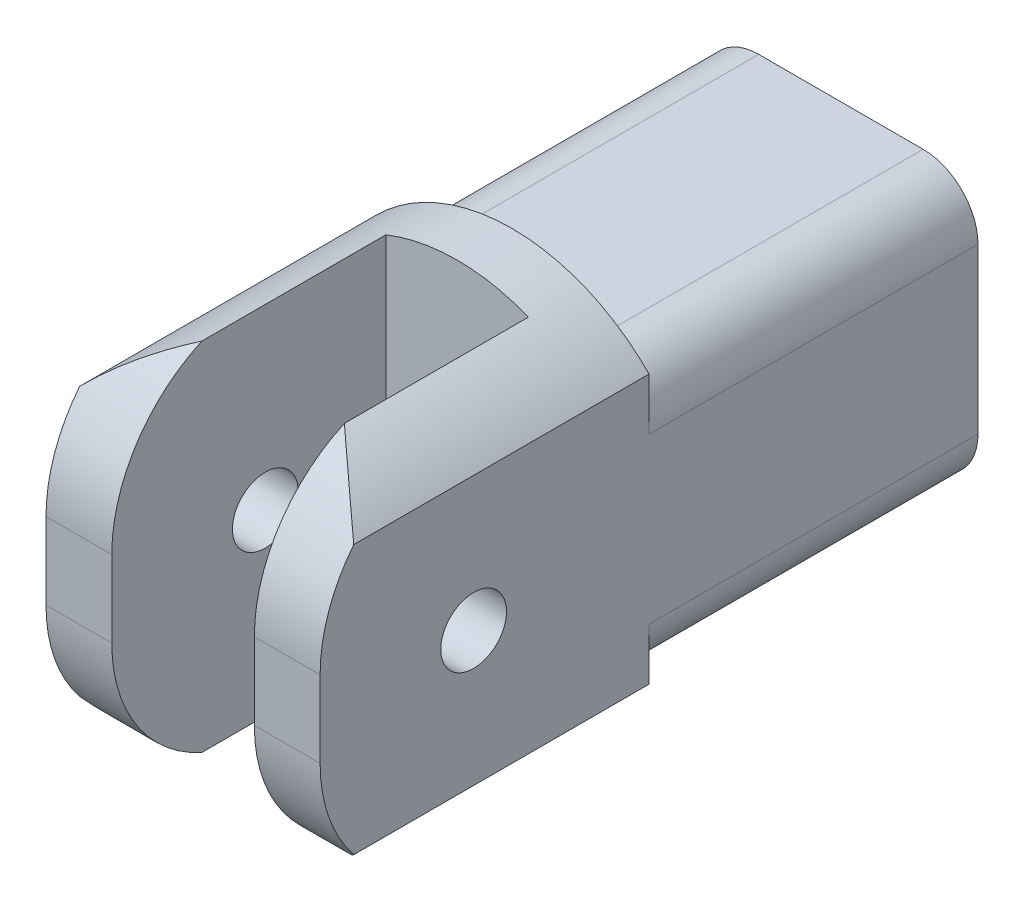
ISO-10303-21;
HEADER;
FILE_DESCRIPTION(('STEP AP214'),'2;1');
FILE_NAME('part.step','',(''),(''),'','','');
FILE_SCHEMA(('AUTOMOTIVE_DESIGN { 1 0 10303 214 1 1 1 1 }'));
ENDSEC;
DATA;
#1=APPLICATION_CONTEXT('core data for automotive mechanical design processes');
#2=APPLICATION_PROTOCOL_DEFINITION('international standard','automotive_design',2000,#1);
#3=PRODUCT_CONTEXT('',#1,'mechanical');
#4=PRODUCT('Part','Part','',(#3));
#5=PRODUCT_RELATED_PRODUCT_CATEGORY('part','',(#4));
#6=PRODUCT_DEFINITION_FORMATION('','',#4);
#7=PRODUCT_DEFINITION_CONTEXT('part definition',#1,'design');
#8=PRODUCT_DEFINITION('design','',#6,#7);
#9=PRODUCT_DEFINITION_SHAPE('','',#8);
#10=(LENGTH_UNIT() NAMED_UNIT(*) SI_UNIT(.MILLI.,.METRE.));
#11=(NAMED_UNIT(*) PLANE_ANGLE_UNIT() SI_UNIT($,.RADIAN.));
#12=(NAMED_UNIT(*) SI_UNIT($,.STERADIAN.) SOLID_ANGLE_UNIT());
#13=UNCERTAINTY_MEASURE_WITH_UNIT(LENGTH_MEASURE(1.E-05),#10,'distance_accuracy_value','');
#14=(GEOMETRIC_REPRESENTATION_CONTEXT(3) GLOBAL_UNCERTAINTY_ASSIGNED_CONTEXT((#13)) GLOBAL_UNIT_ASSIGNED_CONTEXT((#10,
#11,#12)) REPRESENTATION_CONTEXT('',''));
#15=CARTESIAN_POINT('',(0.,0.,0.));
#16=DIRECTION('',(0.,0.,1.));
#17=DIRECTION('',(1.,0.,0.));
#18=AXIS2_PLACEMENT_3D('',#15,#16,#17);
#19=CARTESIAN_POINT('',(25.,3.5,-21.7381489543648));
#20=DIRECTION('',(-1.,0.,0.));
#21=DIRECTION('',(0.,0.,1.));
#22=AXIS2_PLACEMENT_3D('',#19,#20,#21);
#23=CYLINDRICAL_SURFACE('',#22,14.);
#24=CARTESIAN_POINT('',(19.,16.2480768092719,-15.9513935884534));
#25=CARTESIAN_POINT('',(19.2137062616247,16.1625796337887,-15.763056389056));
#26=CARTESIAN_POINT('',(19.4265332479757,16.072552167909,-15.5758066612066));
#27=CARTESIAN_POINT('',(19.850237329306,15.8832582879784,-15.2037387297706));
#28=CARTESIAN_POINT('',(20.0611142136163,15.7839908882665,-15.018920787998));
#29=CARTESIAN_POINT('',(20.6910915022025,15.471779219296,-14.4680112543608));
#30=CARTESIAN_POINT('',(21.1068983672848,15.2446800268905,-14.106028663245));
#31=CARTESIAN_POINT('',(21.9209696044722,14.7552537635126,-13.4014531574795));
#32=CARTESIAN_POINT('',(22.3194044370628,14.4935136185156,-13.0586493528151));
#33=CARTESIAN_POINT('',(23.1023143734355,13.9310075067408,-12.390172447785));
#34=CARTESIAN_POINT('',(23.4868021642348,13.630278207072,-12.0644836511206));
#35=CARTESIAN_POINT('',(24.0568156971809,13.1436352348344,-11.5865857198591));
#36=CARTESIAN_POINT('',(24.2486270052411,12.9725409247646,-11.4266607327881));
#37=CARTESIAN_POINT('',(24.6279106548117,12.6186870646272,-11.1124396010336));
#38=CARTESIAN_POINT('',(24.8153631426692,12.4358845972718,-10.9581678580672));
#39=CARTESIAN_POINT('',(25.,12.2474487139158,-10.8073602821138));
#40=B_SPLINE_CURVE_WITH_KNOTS('',3,(#24,#25,#26,#27,#28,#29,#30,#31,#32,#33,#34,#35,#36,#37,#38,
#39),.UNSPECIFIED.,.F.,.F.,(4,2,2,2,2,2,2,4),(0.,0.892142453159571,1.78438018406066,
3.57152274771991,5.3315434553563,7.08992080870461,7.99781753410152,8.90925727115645),.UNSPECIFIED.);
#41=CARTESIAN_POINT('',(19.,16.2480768092719,-15.9513935884534));
#42=VERTEX_POINT('',#41);
#43=CARTESIAN_POINT('',(25.,12.2474487139158,-10.8073602821138));
#44=VERTEX_POINT('',#43);
#45=EDGE_CURVE('E203',#42,#44,#40,.T.);
#46=ORIENTED_EDGE('',*,*,#45,.F.);
#47=CARTESIAN_POINT('',(19.,3.5,-21.7381489543648));
#48=DIRECTION('',(1.,0.,0.));
#49=DIRECTION('',(0.,0.,-1.));
#50=AXIS2_PLACEMENT_3D('',#47,#48,#49);
#51=CIRCLE('',#50,14.);
#52=CARTESIAN_POINT('',(19.,3.5,-7.73814895436485));
#53=VERTEX_POINT('',#52);
#54=EDGE_CURVE('E336',#42,#53,#51,.T.);
#55=ORIENTED_EDGE('',*,*,#54,.T.);
#56=DIRECTION('',(-1.,0.,0.));
#57=VECTOR('',#56,1.);
#58=CARTESIAN_POINT('',(25.,3.4999999999999,-7.73814895436485));
#59=LINE('',#58,#57);
#60=CARTESIAN_POINT('',(25.,3.4999999999999,-7.73814895436485));
#61=VERTEX_POINT('',#60);
#62=EDGE_CURVE('E251',#61,#53,#59,.T.);
#63=ORIENTED_EDGE('',*,*,#62,.F.);
#64=CARTESIAN_POINT('',(25.,3.5,-21.7381489543648));
#65=DIRECTION('',(1.,0.,0.));
#66=DIRECTION('',(0.,0.,-1.));
#67=AXIS2_PLACEMENT_3D('',#64,#65,#66);
#68=CIRCLE('',#67,14.);
#69=EDGE_CURVE('E213',#44,#61,#68,.T.);
#70=ORIENTED_EDGE('',*,*,#69,.F.);
#71=EDGE_LOOP('',(#46,#55,#63,#70));
#72=FACE_BOUND('',#71,.T.);
#73=ADVANCED_FACE('F53',(#72),#23,.T.);
#74=CARTESIAN_POINT('',(25.,-3.5,-21.7381489543649));
#75=DIRECTION('',(-1.,0.,0.));
#76=DIRECTION('',(0.,0.,1.));
#77=AXIS2_PLACEMENT_3D('',#74,#75,#76);
#78=CYLINDRICAL_SURFACE('',#77,14.);
#79=CARTESIAN_POINT('',(25.,-12.247448713916,-10.8073602821139));
#80=CARTESIAN_POINT('',(24.8182792420741,-12.4329087519221,-10.9557858482555));
#81=CARTESIAN_POINT('',(24.6338314180846,-12.6129113017434,-11.1075670245429));
#82=CARTESIAN_POINT('',(24.2600096271792,-12.9621617203992,-11.4171996226308));
#83=CARTESIAN_POINT('',(24.0706367092498,-13.1314118533565,-11.5750497551867));
#84=CARTESIAN_POINT('',(23.4961751334086,-13.6230711261891,-12.0565286209721));
#85=CARTESIAN_POINT('',(23.1043907332403,-13.9297466006762,-12.3883748923588));
#86=CARTESIAN_POINT('',(22.3118523690837,-14.4987084181039,-13.0651222812422));
#87=CARTESIAN_POINT('',(21.911277162655,-14.7615122290806,-13.4098022024479));
#88=CARTESIAN_POINT('',(21.0991113201426,-15.2489177367404,-14.1128092105947));
#89=CARTESIAN_POINT('',(20.6875219786371,-15.4735239004665,-14.4711346957418));
#90=CARTESIAN_POINT('',(20.0620862546046,-15.7835213858486,-15.018069779364));
#91=CARTESIAN_POINT('',(19.8514485778921,-15.8826939920516,-15.2026767346474));
#92=CARTESIAN_POINT('',(19.4275058851693,-16.0721406934544,-15.5749509254546));
#93=CARTESIAN_POINT('',(19.2141943616068,-16.1623843497352,-15.7626262483462));
#94=CARTESIAN_POINT('',(19.,-16.248076809272,-15.9513935884537));
#95=B_SPLINE_CURVE_WITH_KNOTS('',3,(#79,#80,#81,#82,#83,#84,#85,#86,#87,#88,#89,#90,#91,#92,#93,
#94),.UNSPECIFIED.,.F.,.F.,(4,2,2,2,2,2,2,4),(0.,0.897047580315882,1.79390564006033,
3.58588896623243,5.3549578137075,7.12381963405831,8.01506017764537,8.9092412406068),.UNSPECIFIED.);
#96=CARTESIAN_POINT('',(25.,-12.247448713916,-10.8073602821139));
#97=VERTEX_POINT('',#96);
#98=CARTESIAN_POINT('',(19.,-16.248076809272,-15.9513935884537));
#99=VERTEX_POINT('',#98);
#100=EDGE_CURVE('E415',#97,#99,#95,.T.);
#101=ORIENTED_EDGE('',*,*,#100,.F.);
#102=CARTESIAN_POINT('',(25.,-3.5,-21.7381489543649));
#103=DIRECTION('',(1.,0.,0.));
#104=DIRECTION('',(0.,0.,-1.));
#105=AXIS2_PLACEMENT_3D('',#102,#103,#104);
#106=CIRCLE('',#105,14.);
#107=CARTESIAN_POINT('',(25.,-3.4999999999999,-7.73814895436485));
#108=VERTEX_POINT('',#107);
#109=EDGE_CURVE('E223',#108,#97,#106,.T.);
#110=ORIENTED_EDGE('',*,*,#109,.F.);
#111=DIRECTION('',(-1.,0.,0.));
#112=VECTOR('',#111,1.);
#113=CARTESIAN_POINT('',(25.,-3.4999999999999,-7.73814895436485));
#114=LINE('',#113,#112);
#115=CARTESIAN_POINT('',(19.,-3.5,-7.73814895436485));
#116=VERTEX_POINT('',#115);
#117=EDGE_CURVE('E247',#108,#116,#114,.T.);
#118=ORIENTED_EDGE('',*,*,#117,.T.);
#119=CARTESIAN_POINT('',(19.,-3.5,-21.7381489543649));
#120=DIRECTION('',(1.,0.,0.));
#121=DIRECTION('',(0.,0.,-1.));
#122=AXIS2_PLACEMENT_3D('',#119,#120,#121);
#123=CIRCLE('',#122,14.);
#124=EDGE_CURVE('E333',#116,#99,#123,.T.);
#125=ORIENTED_EDGE('',*,*,#124,.T.);
#126=EDGE_LOOP('',(#101,#110,#118,#125));
#127=FACE_BOUND('',#126,.T.);
#128=ADVANCED_FACE('F376',(#127),#78,.T.);
#129=CARTESIAN_POINT('',(25.,3.5,-21.7381489543648));
#130=DIRECTION('',(1.,0.,0.));
#131=DIRECTION('',(0.,0.,-1.));
#132=AXIS2_PLACEMENT_3D('',#129,#130,#131);
#133=PLANE('',#132);
#134=CARTESIAN_POINT('',(25.,0.,-21.7381489543648));
#135=DIRECTION('',(1.,0.,0.));
#136=DIRECTION('',(0.,0.,-1.));
#137=AXIS2_PLACEMENT_3D('',#134,#135,#136);
#138=CIRCLE('',#137,3.);
#139=CARTESIAN_POINT('',(25.,0.,-24.7381489543648));
#140=VERTEX_POINT('',#139);
#141=EDGE_CURVE('E230',#140,#140,#138,.T.);
#142=ORIENTED_EDGE('',*,*,#141,.F.);
#143=EDGE_LOOP('',(#142));
#144=FACE_BOUND('',#143,.T.);
#145=ORIENTED_EDGE('',*,*,#109,.T.);
#146=DIRECTION('',(0.,0.,-1.));
#147=VECTOR('',#146,1.);
#148=CARTESIAN_POINT('',(25.,-12.247448713916,1.26185104563508));
#149=LINE('',#148,#147);
#150=CARTESIAN_POINT('',(25.,-12.2474487139159,-37.7381489543649));
#151=VERTEX_POINT('',#150);
#152=EDGE_CURVE('E412',#97,#151,#149,.T.);
#153=ORIENTED_EDGE('',*,*,#152,.T.);
#154=DIRECTION('',(0.,1.,0.));
#155=VECTOR('',#154,1.);
#156=CARTESIAN_POINT('',(25.,-17.5,-37.7381489543649));
#157=LINE('',#156,#155);
#158=CARTESIAN_POINT('',(25.,-7.5,-37.7381489543649));
#159=VERTEX_POINT('',#158);
#160=EDGE_CURVE('E68',#151,#159,#157,.T.);
#161=ORIENTED_EDGE('',*,*,#160,.T.);
#162=DIRECTION('',(0.,0.,-1.));
#163=VECTOR('',#162,1.);
#164=CARTESIAN_POINT('',(25.,-7.5,-67.7381489543648));
#165=LINE('',#164,#163);
#166=CARTESIAN_POINT('',(25.,-7.5,-67.7381489543648));
#167=VERTEX_POINT('',#166);
#168=EDGE_CURVE('E292',#159,#167,#165,.T.);
#169=ORIENTED_EDGE('',*,*,#168,.T.);
#170=DIRECTION('',(0.,1.,0.));
#171=VECTOR('',#170,1.);
#172=CARTESIAN_POINT('',(25.,-12.5,-67.7381489543648));
#173=LINE('',#172,#171);
#174=CARTESIAN_POINT('',(25.,7.5,-67.7381489543648));
#175=VERTEX_POINT('',#174);
#176=EDGE_CURVE('E214',#167,#175,#173,.T.);
#177=ORIENTED_EDGE('',*,*,#176,.T.);
#178=DIRECTION('',(0.,0.,1.));
#179=VECTOR('',#178,1.);
#180=CARTESIAN_POINT('',(25.,7.49999999999999,-37.7381489543649));
#181=LINE('',#180,#179);
#182=CARTESIAN_POINT('',(25.,7.49999999999999,-37.7381489543649));
#183=VERTEX_POINT('',#182);
#184=EDGE_CURVE('E212',#175,#183,#181,.T.);
#185=ORIENTED_EDGE('',*,*,#184,.T.);
#186=DIRECTION('',(0.,1.,0.));
#187=VECTOR('',#186,1.);
#188=CARTESIAN_POINT('',(25.,12.5,-37.7381489543649));
#189=LINE('',#188,#187);
#190=CARTESIAN_POINT('',(25.,12.2474487139159,-37.7381489543649));
#191=VERTEX_POINT('',#190);
#192=EDGE_CURVE('E76',#183,#191,#189,.T.);
#193=ORIENTED_EDGE('',*,*,#192,.T.);
#194=DIRECTION('',(0.,0.,-1.));
#195=VECTOR('',#194,1.);
#196=CARTESIAN_POINT('',(25.,12.2474487139158,1.26185104563515));
#197=LINE('',#196,#195);
#198=EDGE_CURVE('E199',#191,#44,#197,.F.);
#199=ORIENTED_EDGE('',*,*,#198,.T.);
#200=ORIENTED_EDGE('',*,*,#69,.T.);
#201=DIRECTION('',(0.,-1.,0.));
#202=VECTOR('',#201,1.);
#203=CARTESIAN_POINT('',(25.,3.4999999999999,-7.73814895436485));
#204=LINE('',#203,#202);
#205=EDGE_CURVE('E216',#61,#108,#204,.T.);
#206=ORIENTED_EDGE('',*,*,#205,.T.);
#207=EDGE_LOOP('',(#145,#153,#161,#169,#177,#185,#193,#199,#200,#206));
#208=FACE_BOUND('',#207,.T.);
#209=ADVANCED_FACE('F209',(#144,#208),#133,.T.);
#210=CARTESIAN_POINT('',(0.,3.5,-21.7381489543648));
#211=DIRECTION('',(1.,0.,0.));
#212=DIRECTION('',(0.,0.,-1.));
#213=AXIS2_PLACEMENT_3D('',#210,#211,#212);
#214=PLANE('',#213);
#215=CARTESIAN_POINT('',(0.,0.,-21.7381489543648));
#216=DIRECTION('',(1.,0.,0.));
#217=DIRECTION('',(0.,0.,-1.));
#218=AXIS2_PLACEMENT_3D('',#215,#216,#217);
#219=CIRCLE('',#218,3.);
#220=CARTESIAN_POINT('',(0.,0.,-24.7381489543648));
#221=VERTEX_POINT('',#220);
#222=EDGE_CURVE('E344',#221,#221,#219,.T.);
#223=ORIENTED_EDGE('',*,*,#222,.T.);
#224=EDGE_LOOP('',(#223));
#225=FACE_BOUND('',#224,.T.);
#226=DIRECTION('',(0.,0.,-1.));
#227=VECTOR('',#226,1.);
#228=CARTESIAN_POINT('',(0.,-12.247448713916,1.26185104563508));
#229=LINE('',#228,#227);
#230=CARTESIAN_POINT('',(0.,-12.247448713916,-10.8073602821139));
#231=VERTEX_POINT('',#230);
#232=CARTESIAN_POINT('',(0.,-12.2474487139159,-37.7381489543649));
#233=VERTEX_POINT('',#232);
#234=EDGE_CURVE('E444',#231,#233,#229,.T.);
#235=ORIENTED_EDGE('',*,*,#234,.F.);
#236=CARTESIAN_POINT('',(0.,-3.5,-21.7381489543649));
#237=DIRECTION('',(1.,0.,0.));
#238=DIRECTION('',(0.,0.,-1.));
#239=AXIS2_PLACEMENT_3D('',#236,#237,#238);
#240=CIRCLE('',#239,14.);
#241=CARTESIAN_POINT('',(0.,-3.4999999999999,-7.73814895436485));
#242=VERTEX_POINT('',#241);
#243=EDGE_CURVE('E237',#242,#231,#240,.T.);
#244=ORIENTED_EDGE('',*,*,#243,.F.);
#245=DIRECTION('',(0.,-1.,0.));
#246=VECTOR('',#245,1.);
#247=CARTESIAN_POINT('',(0.,3.4999999999999,-7.73814895436485));
#248=LINE('',#247,#246);
#249=CARTESIAN_POINT('',(0.,3.4999999999999,-7.73814895436485));
#250=VERTEX_POINT('',#249);
#251=EDGE_CURVE('E234',#250,#242,#248,.T.);
#252=ORIENTED_EDGE('',*,*,#251,.F.);
#253=CARTESIAN_POINT('',(0.,3.5,-21.7381489543648));
#254=DIRECTION('',(1.,0.,0.));
#255=DIRECTION('',(0.,0.,-1.));
#256=AXIS2_PLACEMENT_3D('',#253,#254,#255);
#257=CIRCLE('',#256,14.);
#258=CARTESIAN_POINT('',(0.,12.2474487139158,-10.8073602821138));
#259=VERTEX_POINT('',#258);
#260=EDGE_CURVE('E232',#259,#250,#257,.T.);
#261=ORIENTED_EDGE('',*,*,#260,.F.);
#262=DIRECTION('',(0.,0.,-1.));
#263=VECTOR('',#262,1.);
#264=CARTESIAN_POINT('',(0.,12.2474487139158,1.26185104563515));
#265=LINE('',#264,#263);
#266=CARTESIAN_POINT('',(0.,12.2474487139159,-37.7381489543649));
#267=VERTEX_POINT('',#266);
#268=EDGE_CURVE('E402',#267,#259,#265,.F.);
#269=ORIENTED_EDGE('',*,*,#268,.F.);
#270=DIRECTION('',(0.,1.,0.));
#271=VECTOR('',#270,1.);
#272=CARTESIAN_POINT('',(0.,12.5,-37.7381489543649));
#273=LINE('',#272,#271);
#274=CARTESIAN_POINT('',(0.,7.49999999999999,-37.7381489543649));
#275=VERTEX_POINT('',#274);
#276=EDGE_CURVE('E193',#275,#267,#273,.T.);
#277=ORIENTED_EDGE('',*,*,#276,.F.);
#278=DIRECTION('',(0.,0.,1.));
#279=VECTOR('',#278,1.);
#280=CARTESIAN_POINT('',(0.,7.49999999999999,-21.7381489543648));
#281=LINE('',#280,#279);
#282=CARTESIAN_POINT('',(0.,7.5,-67.7381489543648));
#283=VERTEX_POINT('',#282);
#284=EDGE_CURVE('E281',#275,#283,#281,.F.);
#285=ORIENTED_EDGE('',*,*,#284,.T.);
#286=DIRECTION('',(0.,1.,0.));
#287=VECTOR('',#286,1.);
#288=CARTESIAN_POINT('',(0.,-12.5,-67.7381489543648));
#289=LINE('',#288,#287);
#290=CARTESIAN_POINT('',(0.,-7.5,-67.7381489543648));
#291=VERTEX_POINT('',#290);
#292=EDGE_CURVE('E227',#291,#283,#289,.T.);
#293=ORIENTED_EDGE('',*,*,#292,.F.);
#294=DIRECTION('',(0.,0.,-1.));
#295=VECTOR('',#294,1.);
#296=CARTESIAN_POINT('',(0.,-7.5,-21.7381489543648));
#297=LINE('',#296,#295);
#298=CARTESIAN_POINT('',(0.,-7.5,-37.7381489543649));
#299=VERTEX_POINT('',#298);
#300=EDGE_CURVE('E283',#291,#299,#297,.F.);
#301=ORIENTED_EDGE('',*,*,#300,.T.);
#302=DIRECTION('',(0.,1.,0.));
#303=VECTOR('',#302,1.);
#304=CARTESIAN_POINT('',(0.,-17.5,-37.7381489543649));
#305=LINE('',#304,#303);
#306=EDGE_CURVE('E218',#233,#299,#305,.T.);
#307=ORIENTED_EDGE('',*,*,#306,.F.);
#308=EDGE_LOOP('',(#235,#244,#252,#261,#269,#277,#285,#293,#301,#307));
#309=FACE_BOUND('',#308,.T.);
#310=ADVANCED_FACE('F349',(#225,#309),#214,.F.);
#311=CARTESIAN_POINT('',(25.,12.5,-37.7381489543649));
#312=DIRECTION('',(0.,0.,1.));
#313=DIRECTION('',(0.,-1.,0.));
#314=AXIS2_PLACEMENT_3D('',#311,#312,#313);
#315=PLANE('',#314);
#316=CARTESIAN_POINT('',(12.5,0.,-37.7381489543649));
#317=DIRECTION('',(0.,0.,-1.));
#318=DIRECTION('',(0.,1.,0.));
#319=AXIS2_PLACEMENT_3D('',#316,#317,#318);
#320=CIRCLE('',#319,17.5);
#321=EDGE_CURVE('E189',#267,#191,#320,.T.);
#322=ORIENTED_EDGE('',*,*,#321,.T.);
#323=ORIENTED_EDGE('',*,*,#192,.F.);
#324=CARTESIAN_POINT('',(20.,7.49999999999999,-37.7381489543649));
#325=DIRECTION('',(0.,0.,1.));
#326=DIRECTION('',(0.,-1.,0.));
#327=AXIS2_PLACEMENT_3D('',#324,#325,#326);
#328=CIRCLE('',#327,5.);
#329=CARTESIAN_POINT('',(20.,12.5,-37.7381489543649));
#330=VERTEX_POINT('',#329);
#331=EDGE_CURVE('E299',#183,#330,#328,.T.);
#332=ORIENTED_EDGE('',*,*,#331,.T.);
#333=DIRECTION('',(-1.,0.,0.));
#334=VECTOR('',#333,1.);
#335=CARTESIAN_POINT('',(25.,12.5,-37.7381489543649));
#336=LINE('',#335,#334);
#337=CARTESIAN_POINT('',(5.,12.5,-37.7381489543649));
#338=VERTEX_POINT('',#337);
#339=EDGE_CURVE('E254',#330,#338,#336,.T.);
#340=ORIENTED_EDGE('',*,*,#339,.T.);
#341=CARTESIAN_POINT('',(5.,7.49999999999999,-37.7381489543649));
#342=DIRECTION('',(0.,0.,1.));
#343=DIRECTION('',(0.,-1.,0.));
#344=AXIS2_PLACEMENT_3D('',#341,#342,#343);
#345=CIRCLE('',#344,5.);
#346=EDGE_CURVE('E296',#338,#275,#345,.T.);
#347=ORIENTED_EDGE('',*,*,#346,.T.);
#348=ORIENTED_EDGE('',*,*,#276,.T.);
#349=EDGE_LOOP('',(#322,#323,#332,#340,#347,#348));
#350=FACE_BOUND('',#349,.T.);
#351=ADVANCED_FACE('F191',(#350),#315,.F.);
#352=CARTESIAN_POINT('',(0.,12.2474487139158,-10.8073602821138));
#353=CARTESIAN_POINT('',(0.1817207579259,12.4329087519219,-10.9557858482554));
#354=CARTESIAN_POINT('',(0.366168581915374,12.6129113017433,-11.1075670245428));
#355=CARTESIAN_POINT('',(0.739990372820769,12.962161720399,-11.4171996226307));
#356=CARTESIAN_POINT('',(0.929363290750228,13.1314118533563,-11.5750497551866));
#357=CARTESIAN_POINT('',(1.5038248665914,13.6230711261889,-12.056528620972));
#358=CARTESIAN_POINT('',(1.8956092667597,13.9297466006761,-12.3883748923587));
#359=CARTESIAN_POINT('',(2.68814763091631,14.4987084181037,-13.065122281242));
#360=CARTESIAN_POINT('',(3.08872283734506,14.7615122290804,-13.4098022024477));
#361=CARTESIAN_POINT('',(3.90088867985738,15.2489177367402,-14.1128092105946));
#362=CARTESIAN_POINT('',(4.31247802136292,15.4735239004664,-14.4711346957416));
#363=CARTESIAN_POINT('',(4.93791374539542,15.7835213858485,-15.0180697793637));
#364=CARTESIAN_POINT('',(5.14855142210794,15.8826939920515,-15.2026767346471));
#365=CARTESIAN_POINT('',(5.57249411483075,16.0721406934543,-15.5749509254543));
#366=CARTESIAN_POINT('',(5.78580563839321,16.1623843497351,-15.7626262483459));
#367=CARTESIAN_POINT('',(5.99999999999998,16.2480768092719,-15.9513935884534));
#368=B_SPLINE_CURVE_WITH_KNOTS('',3,(#352,#353,#354,#355,#356,#357,#358,#359,#360,#361,#362,
#363,#364,#365,#366,#367),.UNSPECIFIED.,.F.,.F.,(4,2,2,2,2,2,2,4),(0.,0.897047580315881,
1.79390564006033,3.58588896623242,5.35495781370749,7.12381963405831,8.01506017764533,
8.90924124060673),.UNSPECIFIED.);
#369=CARTESIAN_POINT('',(6.,16.2480768092719,-15.9513935884534));
#370=VERTEX_POINT('',#369);
#371=EDGE_CURVE('E398',#259,#370,#368,.T.);
#372=ORIENTED_EDGE('',*,*,#371,.F.);
#373=ORIENTED_EDGE('',*,*,#260,.T.);
#374=CARTESIAN_POINT('',(6.,3.4999999999999,-7.73814895436485));
#375=VERTEX_POINT('',#374);
#376=EDGE_CURVE('E250',#375,#250,#59,.T.);
#377=ORIENTED_EDGE('',*,*,#376,.F.);
#378=CARTESIAN_POINT('',(6.,3.5,-21.7381489543648));
#379=DIRECTION('',(-1.,0.,0.));
#380=DIRECTION('',(0.,0.,1.));
#381=AXIS2_PLACEMENT_3D('',#378,#379,#380);
#382=CIRCLE('',#381,14.);
#383=EDGE_CURVE('E330',#375,#370,#382,.T.);
#384=ORIENTED_EDGE('',*,*,#383,.T.);
#385=EDGE_LOOP('',(#372,#373,#377,#384));
#386=FACE_BOUND('',#385,.T.);
#387=ADVANCED_FACE('F379',(#386),#23,.T.);
#388=CARTESIAN_POINT('',(6.,-16.248076809272,-15.9513935884537));
#389=CARTESIAN_POINT('',(5.78629373837528,-16.1625796337888,-15.7630563890563));
#390=CARTESIAN_POINT('',(5.57346675202431,-16.0725521679091,-15.5758066612069));
#391=CARTESIAN_POINT('',(5.14976267069398,-15.8832582879785,-15.2037387297708));
#392=CARTESIAN_POINT('',(4.93888578638369,-15.7839908882666,-15.0189207879982));
#393=CARTESIAN_POINT('',(4.30890849779756,-15.4717792192961,-14.468011254361));
#394=CARTESIAN_POINT('',(3.89310163271527,-15.2446800268906,-14.1060286632452));
#395=CARTESIAN_POINT('',(3.07903039552787,-14.7552537635128,-13.4014531574797));
#396=CARTESIAN_POINT('',(2.68059556293722,-14.4935136185158,-13.0586493528153));
#397=CARTESIAN_POINT('',(1.89768562656458,-13.9310075067409,-12.3901724477852));
#398=CARTESIAN_POINT('',(1.51319783576522,-13.6302782070722,-12.0644836511208));
#399=CARTESIAN_POINT('',(0.943184302819133,-13.1436352348346,-11.5865857198593));
#400=CARTESIAN_POINT('',(0.751372994758963,-12.9725409247648,-11.4266607327882));
#401=CARTESIAN_POINT('',(0.372089345188333,-12.6186870646274,-11.1124396010337));
#402=CARTESIAN_POINT('',(0.184636857330794,-12.4358845972719,-10.9581678580674));
#403=CARTESIAN_POINT('',(0.,-12.247448713916,-10.8073602821139));
#404=B_SPLINE_CURVE_WITH_KNOTS('',3,(#388,#389,#390,#391,#392,#393,#394,#395,#396,#397,#398,
#399,#400,#401,#402,#403),.UNSPECIFIED.,.F.,.F.,(4,2,2,2,2,2,2,4),(0.,0.892142453159575,
1.78438018406066,3.57152274771991,5.33154345535631,7.08992080870461,7.99781753410156,
8.90925727115652),.UNSPECIFIED.);
#405=CARTESIAN_POINT('',(6.,-16.248076809272,-15.9513935884537));
#406=VERTEX_POINT('',#405);
#407=EDGE_CURVE('E432',#406,#231,#404,.T.);
#408=ORIENTED_EDGE('',*,*,#407,.F.);
#409=CARTESIAN_POINT('',(6.,-3.5,-21.7381489543649));
#410=DIRECTION('',(-1.,0.,0.));
#411=DIRECTION('',(0.,0.,1.));
#412=AXIS2_PLACEMENT_3D('',#409,#410,#411);
#413=CIRCLE('',#412,14.);
#414=CARTESIAN_POINT('',(6.,-3.5,-7.73814895436485));
#415=VERTEX_POINT('',#414);
#416=EDGE_CURVE('E268',#406,#415,#413,.T.);
#417=ORIENTED_EDGE('',*,*,#416,.T.);
#418=EDGE_CURVE('E246',#415,#242,#114,.T.);
#419=ORIENTED_EDGE('',*,*,#418,.T.);
#420=ORIENTED_EDGE('',*,*,#243,.T.);
#421=EDGE_LOOP('',(#408,#417,#419,#420));
#422=FACE_BOUND('',#421,.T.);
#423=ADVANCED_FACE('F385',(#422),#78,.T.);
#424=CARTESIAN_POINT('',(25.,-17.5,-37.7381489543649));
#425=DIRECTION('',(0.,0.,1.));
#426=DIRECTION('',(0.,-1.,0.));
#427=AXIS2_PLACEMENT_3D('',#424,#425,#426);
#428=PLANE('',#427);
#429=EDGE_CURVE('E196',#151,#233,#320,.T.);
#430=ORIENTED_EDGE('',*,*,#429,.T.);
#431=ORIENTED_EDGE('',*,*,#306,.T.);
#432=CARTESIAN_POINT('',(5.,-7.5,-37.7381489543649));
#433=DIRECTION('',(0.,0.,1.));
#434=DIRECTION('',(0.,-1.,0.));
#435=AXIS2_PLACEMENT_3D('',#432,#433,#434);
#436=CIRCLE('',#435,5.);
#437=CARTESIAN_POINT('',(5.,-12.5,-37.7381489543649));
#438=VERTEX_POINT('',#437);
#439=EDGE_CURVE('E294',#299,#438,#436,.T.);
#440=ORIENTED_EDGE('',*,*,#439,.T.);
#441=DIRECTION('',(-1.,0.,0.));
#442=VECTOR('',#441,1.);
#443=CARTESIAN_POINT('',(25.,-12.5,-37.7381489543649));
#444=LINE('',#443,#442);
#445=CARTESIAN_POINT('',(20.,-12.5,-37.7381489543649));
#446=VERTEX_POINT('',#445);
#447=EDGE_CURVE('E243',#446,#438,#444,.T.);
#448=ORIENTED_EDGE('',*,*,#447,.F.);
#449=CARTESIAN_POINT('',(20.,-7.5,-37.7381489543649));
#450=DIRECTION('',(0.,0.,1.));
#451=DIRECTION('',(0.,-1.,0.));
#452=AXIS2_PLACEMENT_3D('',#449,#450,#451);
#453=CIRCLE('',#452,5.);
#454=EDGE_CURVE('E298',#446,#159,#453,.T.);
#455=ORIENTED_EDGE('',*,*,#454,.T.);
#456=ORIENTED_EDGE('',*,*,#160,.F.);
#457=EDGE_LOOP('',(#430,#431,#440,#448,#455,#456));
#458=FACE_BOUND('',#457,.T.);
#459=ADVANCED_FACE('F395',(#458),#428,.F.);
#460=CARTESIAN_POINT('',(19.,-20.2438244759711,-32.7381489543649));
#461=DIRECTION('',(1.,0.,0.));
#462=DIRECTION('',(0.,0.,-1.));
#463=AXIS2_PLACEMENT_3D('',#460,#461,#462);
#464=PLANE('',#463);
#465=CARTESIAN_POINT('',(19.,0.,-21.7381489543648));
#466=DIRECTION('',(1.,0.,0.));
#467=DIRECTION('',(0.,0.,-1.));
#468=AXIS2_PLACEMENT_3D('',#465,#466,#467);
#469=CIRCLE('',#468,3.);
#470=CARTESIAN_POINT('',(19.,0.,-24.7381489543648));
#471=VERTEX_POINT('',#470);
#472=EDGE_CURVE('E338',#471,#471,#469,.T.);
#473=ORIENTED_EDGE('',*,*,#472,.T.);
#474=EDGE_LOOP('',(#473));
#475=FACE_BOUND('',#474,.T.);
#476=DIRECTION('',(0.,0.,-1.));
#477=VECTOR('',#476,1.);
#478=CARTESIAN_POINT('',(19.,-16.248076809272,1.26185104563507));
#479=LINE('',#478,#477);
#480=CARTESIAN_POINT('',(19.,-16.2480768092719,-32.7381489543649));
#481=VERTEX_POINT('',#480);
#482=EDGE_CURVE('E308',#99,#481,#479,.T.);
#483=ORIENTED_EDGE('',*,*,#482,.F.);
#484=ORIENTED_EDGE('',*,*,#124,.F.);
#485=DIRECTION('',(0.,1.,0.));
#486=VECTOR('',#485,1.);
#487=CARTESIAN_POINT('',(19.,-20.2438244759711,-7.73814895436485));
#488=LINE('',#487,#486);
#489=EDGE_CURVE('E205',#116,#53,#488,.T.);
#490=ORIENTED_EDGE('',*,*,#489,.T.);
#491=ORIENTED_EDGE('',*,*,#54,.F.);
#492=DIRECTION('',(0.,0.,-1.));
#493=VECTOR('',#492,1.);
#494=CARTESIAN_POINT('',(19.,16.2480768092718,1.26185104563516));
#495=LINE('',#494,#493);
#496=CARTESIAN_POINT('',(19.,16.2480768092719,-32.7381489543649));
#497=VERTEX_POINT('',#496);
#498=EDGE_CURVE('E403',#497,#42,#495,.F.);
#499=ORIENTED_EDGE('',*,*,#498,.F.);
#500=DIRECTION('',(0.,1.,0.));
#501=VECTOR('',#500,1.);
#502=CARTESIAN_POINT('',(19.,-20.2438244759711,-32.7381489543649));
#503=LINE('',#502,#501);
#504=EDGE_CURVE('E321',#481,#497,#503,.T.);
#505=ORIENTED_EDGE('',*,*,#504,.F.);
#506=EDGE_LOOP('',(#483,#484,#490,#491,#499,#505));
#507=FACE_BOUND('',#506,.T.);
#508=ADVANCED_FACE('F468',(#475,#507),#464,.F.);
#509=CARTESIAN_POINT('',(6.,-20.2438244759711,-32.7381489543649));
#510=DIRECTION('',(-1.,0.,0.));
#511=DIRECTION('',(0.,0.,1.));
#512=AXIS2_PLACEMENT_3D('',#509,#510,#511);
#513=PLANE('',#512);
#514=CARTESIAN_POINT('',(6.,0.,-21.7381489543648));
#515=DIRECTION('',(-1.,0.,0.));
#516=DIRECTION('',(0.,0.,1.));
#517=AXIS2_PLACEMENT_3D('',#514,#515,#516);
#518=CIRCLE('',#517,3.);
#519=CARTESIAN_POINT('',(6.,0.,-18.7381489543648));
#520=VERTEX_POINT('',#519);
#521=EDGE_CURVE('E264',#520,#520,#518,.T.);
#522=ORIENTED_EDGE('',*,*,#521,.T.);
#523=EDGE_LOOP('',(#522));
#524=FACE_BOUND('',#523,.T.);
#525=DIRECTION('',(0.,0.,-1.));
#526=VECTOR('',#525,1.);
#527=CARTESIAN_POINT('',(6.,16.2480768092718,1.26185104563516));
#528=LINE('',#527,#526);
#529=CARTESIAN_POINT('',(6.,16.2480768092719,-32.7381489543649));
#530=VERTEX_POINT('',#529);
#531=EDGE_CURVE('E411',#370,#530,#528,.T.);
#532=ORIENTED_EDGE('',*,*,#531,.F.);
#533=ORIENTED_EDGE('',*,*,#383,.F.);
#534=DIRECTION('',(0.,-1.,0.));
#535=VECTOR('',#534,1.);
#536=CARTESIAN_POINT('',(6.,-20.2438244759711,-7.73814895436485));
#537=LINE('',#536,#535);
#538=EDGE_CURVE('E323',#375,#415,#537,.T.);
#539=ORIENTED_EDGE('',*,*,#538,.T.);
#540=ORIENTED_EDGE('',*,*,#416,.F.);
#541=DIRECTION('',(0.,0.,-1.));
#542=VECTOR('',#541,1.);
#543=CARTESIAN_POINT('',(6.,-16.248076809272,1.26185104563507));
#544=LINE('',#543,#542);
#545=CARTESIAN_POINT('',(6.,-16.2480768092719,-32.7381489543649));
#546=VERTEX_POINT('',#545);
#547=EDGE_CURVE('E305',#546,#406,#544,.F.);
#548=ORIENTED_EDGE('',*,*,#547,.F.);
#549=DIRECTION('',(0.,-1.,0.));
#550=VECTOR('',#549,1.);
#551=CARTESIAN_POINT('',(6.,-20.2438244759711,-32.7381489543649));
#552=LINE('',#551,#550);
#553=EDGE_CURVE('E265',#530,#546,#552,.T.);
#554=ORIENTED_EDGE('',*,*,#553,.F.);
#555=EDGE_LOOP('',(#532,#533,#539,#540,#548,#554));
#556=FACE_BOUND('',#555,.T.);
#557=ADVANCED_FACE('F317',(#524,#556),#513,.F.);
#558=CARTESIAN_POINT('',(0.,0.,-32.7381489543649));
#559=DIRECTION('',(0.,0.,-1.));
#560=DIRECTION('',(-1.,0.,0.));
#561=AXIS2_PLACEMENT_3D('',#558,#559,#560);
#562=PLANE('',#561);
#563=CARTESIAN_POINT('',(12.5,0.,-32.7381489543648));
#564=DIRECTION('',(0.,0.,-1.));
#565=DIRECTION('',(-1.,0.,0.));
#566=AXIS2_PLACEMENT_3D('',#563,#564,#565);
#567=CIRCLE('',#566,6.4);
#568=CARTESIAN_POINT('',(6.1,0.,-32.7381489543648));
#569=VERTEX_POINT('',#568);
#570=EDGE_CURVE('E261',#569,#569,#567,.F.);
#571=ORIENTED_EDGE('',*,*,#570,.F.);
#572=EDGE_LOOP('',(#571));
#573=FACE_BOUND('',#572,.T.);
#574=CARTESIAN_POINT('',(12.5,0.,-32.7381489543649));
#575=DIRECTION('',(0.,0.,-1.));
#576=DIRECTION('',(-1.,0.,0.));
#577=AXIS2_PLACEMENT_3D('',#574,#575,#576);
#578=CIRCLE('',#577,17.5);
#579=EDGE_CURVE('E13',#530,#497,#578,.T.);
#580=ORIENTED_EDGE('',*,*,#579,.F.);
#581=ORIENTED_EDGE('',*,*,#553,.T.);
#582=EDGE_CURVE('E57',#481,#546,#578,.T.);
#583=ORIENTED_EDGE('',*,*,#582,.F.);
#584=ORIENTED_EDGE('',*,*,#504,.T.);
#585=EDGE_LOOP('',(#580,#581,#583,#584));
#586=FACE_BOUND('',#585,.T.);
#587=ADVANCED_FACE('F320',(#573,#586),#562,.F.);
#588=CARTESIAN_POINT('',(25.,3.4999999999999,-7.73814895436485));
#589=DIRECTION('',(0.,0.,-1.));
#590=DIRECTION('',(0.,1.,0.));
#591=AXIS2_PLACEMENT_3D('',#588,#589,#590);
#592=PLANE('',#591);
#593=ORIENTED_EDGE('',*,*,#62,.T.);
#594=ORIENTED_EDGE('',*,*,#489,.F.);
#595=ORIENTED_EDGE('',*,*,#117,.F.);
#596=ORIENTED_EDGE('',*,*,#205,.F.);
#597=EDGE_LOOP('',(#593,#594,#595,#596));
#598=FACE_BOUND('',#597,.T.);
#599=ADVANCED_FACE('F373',(#598),#592,.F.);
#600=CARTESIAN_POINT('',(25.,0.,-21.7381489543648));
#601=DIRECTION('',(-1.,0.,0.));
#602=DIRECTION('',(0.,0.,1.));
#603=AXIS2_PLACEMENT_3D('',#600,#601,#602);
#604=CYLINDRICAL_SURFACE('',#603,3.);
#605=ORIENTED_EDGE('',*,*,#472,.F.);
#606=EDGE_LOOP('',(#605));
#607=FACE_BOUND('',#606,.T.);
#608=ORIENTED_EDGE('',*,*,#141,.T.);
#609=EDGE_LOOP('',(#608));
#610=FACE_BOUND('',#609,.T.);
#611=ADVANCED_FACE('F358',(#607,#610),#604,.F.);
#612=CARTESIAN_POINT('',(25.,-12.5,-67.7381489543648));
#613=DIRECTION('',(0.,0.,1.));
#614=DIRECTION('',(1.,0.,0.));
#615=AXIS2_PLACEMENT_3D('',#612,#613,#614);
#616=PLANE('',#615);
#617=CARTESIAN_POINT('',(12.5,0.,-67.7381489543648));
#618=DIRECTION('',(0.,0.,-1.));
#619=DIRECTION('',(-1.,0.,0.));
#620=AXIS2_PLACEMENT_3D('',#617,#618,#619);
#621=CIRCLE('',#620,6.4);
#622=CARTESIAN_POINT('',(6.1,0.,-67.7381489543648));
#623=VERTEX_POINT('',#622);
#624=EDGE_CURVE('E341',#623,#623,#621,.T.);
#625=ORIENTED_EDGE('',*,*,#624,.F.);
#626=EDGE_LOOP('',(#625));
#627=FACE_BOUND('',#626,.T.);
#628=DIRECTION('',(-1.,0.,0.));
#629=VECTOR('',#628,1.);
#630=CARTESIAN_POINT('',(25.,-12.5,-67.7381489543648));
#631=LINE('',#630,#629);
#632=CARTESIAN_POINT('',(20.,-12.5,-67.7381489543648));
#633=VERTEX_POINT('',#632);
#634=CARTESIAN_POINT('',(5.,-12.5,-67.7381489543648));
#635=VERTEX_POINT('',#634);
#636=EDGE_CURVE('E226',#633,#635,#631,.T.);
#637=ORIENTED_EDGE('',*,*,#636,.T.);
#638=CARTESIAN_POINT('',(5.,-7.5,-67.7381489543648));
#639=DIRECTION('',(0.,0.,1.));
#640=DIRECTION('',(1.,0.,0.));
#641=AXIS2_PLACEMENT_3D('',#638,#639,#640);
#642=CIRCLE('',#641,5.);
#643=EDGE_CURVE('E279',#635,#291,#642,.F.);
#644=ORIENTED_EDGE('',*,*,#643,.T.);
#645=ORIENTED_EDGE('',*,*,#292,.T.);
#646=CARTESIAN_POINT('',(5.,7.5,-67.7381489543648));
#647=DIRECTION('',(0.,0.,1.));
#648=DIRECTION('',(1.,0.,0.));
#649=AXIS2_PLACEMENT_3D('',#646,#647,#648);
#650=CIRCLE('',#649,5.);
#651=CARTESIAN_POINT('',(5.,12.5,-67.7381489543648));
#652=VERTEX_POINT('',#651);
#653=EDGE_CURVE('E277',#283,#652,#650,.F.);
#654=ORIENTED_EDGE('',*,*,#653,.T.);
#655=DIRECTION('',(-1.,0.,0.));
#656=VECTOR('',#655,1.);
#657=CARTESIAN_POINT('',(25.,12.5,-67.7381489543648));
#658=LINE('',#657,#656);
#659=CARTESIAN_POINT('',(20.,12.5,-67.7381489543648));
#660=VERTEX_POINT('',#659);
#661=EDGE_CURVE('E257',#660,#652,#658,.T.);
#662=ORIENTED_EDGE('',*,*,#661,.F.);
#663=CARTESIAN_POINT('',(20.,7.5,-67.7381489543648));
#664=DIRECTION('',(0.,0.,1.));
#665=DIRECTION('',(1.,0.,0.));
#666=AXIS2_PLACEMENT_3D('',#663,#664,#665);
#667=CIRCLE('',#666,5.);
#668=EDGE_CURVE('E273',#660,#175,#667,.F.);
#669=ORIENTED_EDGE('',*,*,#668,.T.);
#670=ORIENTED_EDGE('',*,*,#176,.F.);
#671=CARTESIAN_POINT('',(20.,-7.5,-67.7381489543648));
#672=DIRECTION('',(0.,0.,1.));
#673=DIRECTION('',(1.,0.,0.));
#674=AXIS2_PLACEMENT_3D('',#671,#672,#673);
#675=CIRCLE('',#674,5.);
#676=EDGE_CURVE('E275',#167,#633,#675,.F.);
#677=ORIENTED_EDGE('',*,*,#676,.T.);
#678=EDGE_LOOP('',(#637,#644,#645,#654,#662,#669,#670,#677));
#679=FACE_BOUND('',#678,.T.);
#680=ADVANCED_FACE('F372',(#627,#679),#616,.F.);
#681=CARTESIAN_POINT('',(25.,12.5,-67.7381489543648));
#682=DIRECTION('',(0.,-1.,0.));
#683=DIRECTION('',(0.,0.,-1.));
#684=AXIS2_PLACEMENT_3D('',#681,#682,#683);
#685=PLANE('',#684);
#686=ORIENTED_EDGE('',*,*,#661,.T.);
#687=DIRECTION('',(0.,0.,1.));
#688=VECTOR('',#687,1.);
#689=CARTESIAN_POINT('',(5.,12.5,-67.7381489543648));
#690=LINE('',#689,#688);
#691=EDGE_CURVE('E288',#652,#338,#690,.T.);
#692=ORIENTED_EDGE('',*,*,#691,.T.);
#693=ORIENTED_EDGE('',*,*,#339,.F.);
#694=DIRECTION('',(0.,0.,1.));
#695=VECTOR('',#694,1.);
#696=CARTESIAN_POINT('',(20.,12.5,-67.7381489543648));
#697=LINE('',#696,#695);
#698=EDGE_CURVE('E286',#330,#660,#697,.F.);
#699=ORIENTED_EDGE('',*,*,#698,.T.);
#700=EDGE_LOOP('',(#686,#692,#693,#699));
#701=FACE_BOUND('',#700,.T.);
#702=ADVANCED_FACE('F449',(#701),#685,.F.);
#703=ORIENTED_EDGE('',*,*,#418,.F.);
#704=ORIENTED_EDGE('',*,*,#538,.F.);
#705=ORIENTED_EDGE('',*,*,#376,.T.);
#706=ORIENTED_EDGE('',*,*,#251,.T.);
#707=EDGE_LOOP('',(#703,#704,#705,#706));
#708=FACE_BOUND('',#707,.T.);
#709=ADVANCED_FACE('F366',(#708),#592,.F.);
#710=CARTESIAN_POINT('',(25.,-12.5,-37.7381489543649));
#711=DIRECTION('',(0.,1.,0.));
#712=DIRECTION('',(0.,0.,1.));
#713=AXIS2_PLACEMENT_3D('',#710,#711,#712);
#714=PLANE('',#713);
#715=ORIENTED_EDGE('',*,*,#447,.T.);
#716=DIRECTION('',(0.,0.,-1.));
#717=VECTOR('',#716,1.);
#718=CARTESIAN_POINT('',(5.,-12.5,-37.7381489543649));
#719=LINE('',#718,#717);
#720=EDGE_CURVE('E270',#438,#635,#719,.T.);
#721=ORIENTED_EDGE('',*,*,#720,.T.);
#722=ORIENTED_EDGE('',*,*,#636,.F.);
#723=DIRECTION('',(0.,0.,-1.));
#724=VECTOR('',#723,1.);
#725=CARTESIAN_POINT('',(20.,-12.5,-37.7381489543649));
#726=LINE('',#725,#724);
#727=EDGE_CURVE('E260',#633,#446,#726,.F.);
#728=ORIENTED_EDGE('',*,*,#727,.T.);
#729=EDGE_LOOP('',(#715,#721,#722,#728));
#730=FACE_BOUND('',#729,.T.);
#731=ADVANCED_FACE('F355',(#730),#714,.F.);
#732=ORIENTED_EDGE('',*,*,#521,.F.);
#733=EDGE_LOOP('',(#732));
#734=FACE_BOUND('',#733,.T.);
#735=ORIENTED_EDGE('',*,*,#222,.F.);
#736=EDGE_LOOP('',(#735));
#737=FACE_BOUND('',#736,.T.);
#738=ADVANCED_FACE('F352',(#734,#737),#604,.F.);
#739=CARTESIAN_POINT('',(12.5,0.,40.2618510456352));
#740=DIRECTION('',(0.,0.,-1.));
#741=DIRECTION('',(-1.,0.,0.));
#742=AXIS2_PLACEMENT_3D('',#739,#740,#741);
#743=CYLINDRICAL_SURFACE('',#742,6.4);
#744=ORIENTED_EDGE('',*,*,#570,.T.);
#745=EDGE_LOOP('',(#744));
#746=FACE_BOUND('',#745,.T.);
#747=ORIENTED_EDGE('',*,*,#624,.T.);
#748=EDGE_LOOP('',(#747));
#749=FACE_BOUND('',#748,.T.);
#750=ADVANCED_FACE('F354',(#746,#749),#743,.F.);
#751=CARTESIAN_POINT('',(5.,-7.5,-37.7381489543649));
#752=DIRECTION('',(0.,0.,-1.));
#753=DIRECTION('',(-1.,0.,0.));
#754=AXIS2_PLACEMENT_3D('',#751,#752,#753);
#755=CYLINDRICAL_SURFACE('',#754,5.);
#756=ORIENTED_EDGE('',*,*,#439,.F.);
#757=ORIENTED_EDGE('',*,*,#300,.F.);
#758=ORIENTED_EDGE('',*,*,#643,.F.);
#759=ORIENTED_EDGE('',*,*,#720,.F.);
#760=EDGE_LOOP('',(#756,#757,#758,#759));
#761=FACE_BOUND('',#760,.T.);
#762=ADVANCED_FACE('F363',(#761),#755,.T.);
#763=CARTESIAN_POINT('',(5.,7.5,-67.7381489543648));
#764=DIRECTION('',(0.,0.,1.));
#765=DIRECTION('',(0.,-1.,0.));
#766=AXIS2_PLACEMENT_3D('',#763,#764,#765);
#767=CYLINDRICAL_SURFACE('',#766,5.);
#768=ORIENTED_EDGE('',*,*,#653,.F.);
#769=ORIENTED_EDGE('',*,*,#284,.F.);
#770=ORIENTED_EDGE('',*,*,#346,.F.);
#771=ORIENTED_EDGE('',*,*,#691,.F.);
#772=EDGE_LOOP('',(#768,#769,#770,#771));
#773=FACE_BOUND('',#772,.T.);
#774=ADVANCED_FACE('F490',(#773),#767,.T.);
#775=CARTESIAN_POINT('',(20.,-7.5,-21.7381489543648));
#776=DIRECTION('',(0.,0.,1.));
#777=DIRECTION('',(1.,0.,0.));
#778=AXIS2_PLACEMENT_3D('',#775,#776,#777);
#779=CYLINDRICAL_SURFACE('',#778,5.);
#780=ORIENTED_EDGE('',*,*,#454,.F.);
#781=ORIENTED_EDGE('',*,*,#727,.F.);
#782=ORIENTED_EDGE('',*,*,#676,.F.);
#783=ORIENTED_EDGE('',*,*,#168,.F.);
#784=EDGE_LOOP('',(#780,#781,#782,#783));
#785=FACE_BOUND('',#784,.T.);
#786=ADVANCED_FACE('F478',(#785),#779,.T.);
#787=CARTESIAN_POINT('',(20.,7.49999999999999,-21.7381489543648));
#788=DIRECTION('',(0.,0.,-1.));
#789=DIRECTION('',(0.,1.,0.));
#790=AXIS2_PLACEMENT_3D('',#787,#788,#789);
#791=CYLINDRICAL_SURFACE('',#790,5.);
#792=ORIENTED_EDGE('',*,*,#668,.F.);
#793=ORIENTED_EDGE('',*,*,#698,.F.);
#794=ORIENTED_EDGE('',*,*,#331,.F.);
#795=ORIENTED_EDGE('',*,*,#184,.F.);
#796=EDGE_LOOP('',(#792,#793,#794,#795));
#797=FACE_BOUND('',#796,.T.);
#798=ADVANCED_FACE('F55',(#797),#791,.T.);
#799=CARTESIAN_POINT('',(12.5,-1.09320472245864E-13,1.26185104563512));
#800=DIRECTION('',(0.,0.,-1.));
#801=DIRECTION('',(0.,1.,0.));
#802=AXIS2_PLACEMENT_3D('',#799,#800,#801);
#803=CYLINDRICAL_SURFACE('',#802,17.5);
#804=ORIENTED_EDGE('',*,*,#482,.T.);
#805=ORIENTED_EDGE('',*,*,#582,.T.);
#806=ORIENTED_EDGE('',*,*,#547,.T.);
#807=ORIENTED_EDGE('',*,*,#407,.T.);
#808=ORIENTED_EDGE('',*,*,#234,.T.);
#809=ORIENTED_EDGE('',*,*,#429,.F.);
#810=ORIENTED_EDGE('',*,*,#152,.F.);
#811=ORIENTED_EDGE('',*,*,#100,.T.);
#812=EDGE_LOOP('',(#804,#805,#806,#807,#808,#809,#810,#811));
#813=FACE_BOUND('',#812,.T.);
#814=ADVANCED_FACE('F304',(#813),#803,.T.);
#815=ORIENTED_EDGE('',*,*,#531,.T.);
#816=ORIENTED_EDGE('',*,*,#579,.T.);
#817=ORIENTED_EDGE('',*,*,#498,.T.);
#818=ORIENTED_EDGE('',*,*,#45,.T.);
#819=ORIENTED_EDGE('',*,*,#198,.F.);
#820=ORIENTED_EDGE('',*,*,#321,.F.);
#821=ORIENTED_EDGE('',*,*,#268,.T.);
#822=ORIENTED_EDGE('',*,*,#371,.T.);
#823=EDGE_LOOP('',(#815,#816,#817,#818,#819,#820,#821,#822));
#824=FACE_BOUND('',#823,.T.);
#825=ADVANCED_FACE('F201',(#824),#803,.T.);
#826=CLOSED_SHELL('',(#73,#128,#209,#310,#351,#387,#423,#459,#508,#557,#587,#599,#611,#680,#702,
#709,#731,#738,#750,#762,#774,#786,#798,#814,#825));
#827=MANIFOLD_SOLID_BREP('B2',#826);
#828=ADVANCED_BREP_SHAPE_REPRESENTATION('',(#18,#827),#14);
#829=SHAPE_DEFINITION_REPRESENTATION(#9,#828);
ENDSEC;
END-ISO-10303-21;
